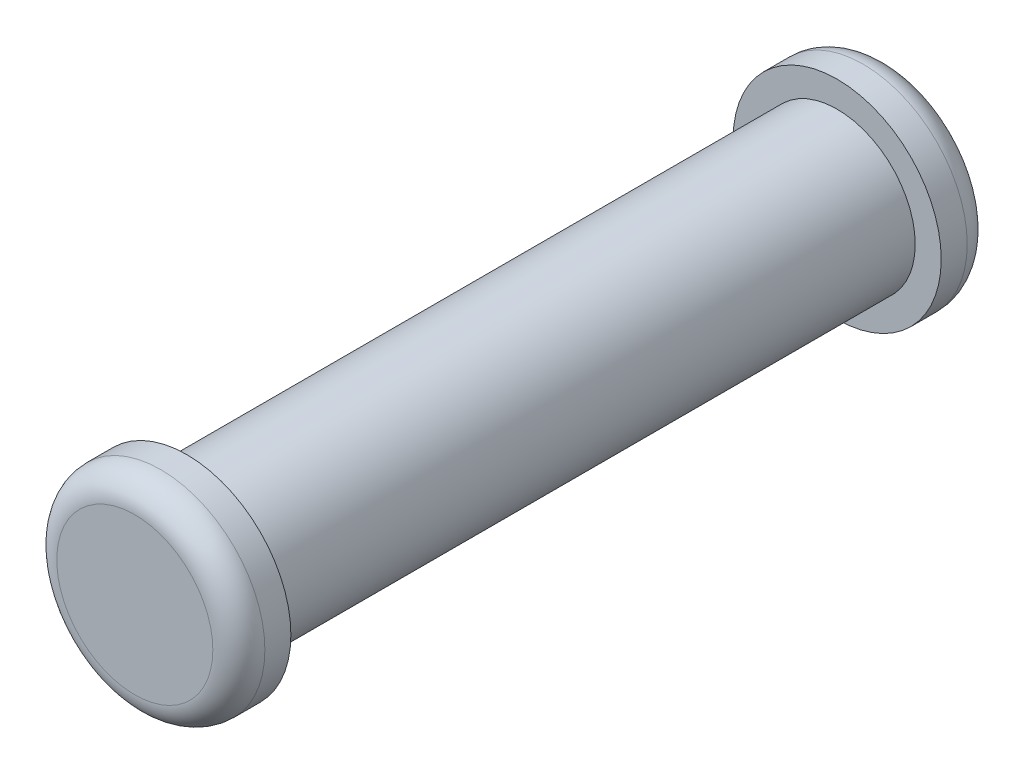
ISO-10303-21;
HEADER;
FILE_DESCRIPTION(('STEP AP214'),'2;1');
FILE_NAME('part.step','',(''),(''),'','','');
FILE_SCHEMA(('AUTOMOTIVE_DESIGN { 1 0 10303 214 1 1 1 1 }'));
ENDSEC;
DATA;
#1=APPLICATION_CONTEXT('core data for automotive mechanical design processes');
#2=APPLICATION_PROTOCOL_DEFINITION('international standard','automotive_design',2000,#1);
#3=PRODUCT_CONTEXT('',#1,'mechanical');
#4=PRODUCT('Part','Part','',(#3));
#5=PRODUCT_RELATED_PRODUCT_CATEGORY('part','',(#4));
#6=PRODUCT_DEFINITION_FORMATION('','',#4);
#7=PRODUCT_DEFINITION_CONTEXT('part definition',#1,'design');
#8=PRODUCT_DEFINITION('design','',#6,#7);
#9=PRODUCT_DEFINITION_SHAPE('','',#8);
#10=(LENGTH_UNIT() NAMED_UNIT(*) SI_UNIT(.MILLI.,.METRE.));
#11=(NAMED_UNIT(*) PLANE_ANGLE_UNIT() SI_UNIT($,.RADIAN.));
#12=(NAMED_UNIT(*) SI_UNIT($,.STERADIAN.) SOLID_ANGLE_UNIT());
#13=UNCERTAINTY_MEASURE_WITH_UNIT(LENGTH_MEASURE(1.E-05),#10,'distance_accuracy_value','');
#14=(GEOMETRIC_REPRESENTATION_CONTEXT(3) GLOBAL_UNCERTAINTY_ASSIGNED_CONTEXT((#13)) GLOBAL_UNIT_ASSIGNED_CONTEXT((#10,
#11,#12)) REPRESENTATION_CONTEXT('',''));
#15=CARTESIAN_POINT('',(0.,0.,0.));
#16=DIRECTION('',(0.,0.,1.));
#17=DIRECTION('',(1.,0.,0.));
#18=AXIS2_PLACEMENT_3D('',#15,#16,#17);
#19=CARTESIAN_POINT('',(0.,0.,12.5));
#20=DIRECTION('',(0.,0.,-1.));
#21=DIRECTION('',(-1.,0.,0.));
#22=AXIS2_PLACEMENT_3D('',#19,#20,#21);
#23=CYLINDRICAL_SURFACE('',#22,1.5);
#24=CARTESIAN_POINT('',(0.,0.,12.5));
#25=DIRECTION('',(0.,0.,1.));
#26=DIRECTION('',(1.,0.,0.));
#27=AXIS2_PLACEMENT_3D('',#24,#25,#26);
#28=CIRCLE('',#27,1.5);
#29=CARTESIAN_POINT('',(1.5,0.,12.5));
#30=VERTEX_POINT('',#29);
#31=EDGE_CURVE('E59',#30,#30,#28,.T.);
#32=ORIENTED_EDGE('',*,*,#31,.F.);
#33=EDGE_LOOP('',(#32));
#34=FACE_BOUND('',#33,.T.);
#35=CARTESIAN_POINT('',(0.,0.,0.));
#36=DIRECTION('',(0.,0.,1.));
#37=DIRECTION('',(1.,0.,0.));
#38=AXIS2_PLACEMENT_3D('',#35,#36,#37);
#39=CIRCLE('',#38,1.5);
#40=CARTESIAN_POINT('',(1.5,0.,0.));
#41=VERTEX_POINT('',#40);
#42=EDGE_CURVE('E60',#41,#41,#39,.T.);
#43=ORIENTED_EDGE('',*,*,#42,.T.);
#44=EDGE_LOOP('',(#43));
#45=FACE_BOUND('',#44,.T.);
#46=ADVANCED_FACE('F39',(#34,#45),#23,.T.);
#47=CARTESIAN_POINT('',(0.,0.,-1.));
#48=DIRECTION('',(0.,0.,1.));
#49=DIRECTION('',(1.,0.,0.));
#50=AXIS2_PLACEMENT_3D('',#47,#48,#49);
#51=CYLINDRICAL_SURFACE('',#50,2.);
#52=CARTESIAN_POINT('',(0.,0.,-0.5));
#53=DIRECTION('',(0.,0.,-1.));
#54=DIRECTION('',(-1.,0.,0.));
#55=AXIS2_PLACEMENT_3D('',#52,#53,#54);
#56=CIRCLE('',#55,2.);
#57=CARTESIAN_POINT('',(-2.,0.,-0.5));
#58=VERTEX_POINT('',#57);
#59=EDGE_CURVE('E50',#58,#58,#56,.F.);
#60=ORIENTED_EDGE('',*,*,#59,.T.);
#61=EDGE_LOOP('',(#60));
#62=FACE_BOUND('',#61,.T.);
#63=CARTESIAN_POINT('',(0.,0.,0.));
#64=DIRECTION('',(0.,0.,-1.));
#65=DIRECTION('',(-1.,0.,0.));
#66=AXIS2_PLACEMENT_3D('',#63,#64,#65);
#67=CIRCLE('',#66,2.);
#68=CARTESIAN_POINT('',(-2.,0.,0.));
#69=VERTEX_POINT('',#68);
#70=EDGE_CURVE('E63',#69,#69,#67,.T.);
#71=ORIENTED_EDGE('',*,*,#70,.T.);
#72=EDGE_LOOP('',(#71));
#73=FACE_BOUND('',#72,.T.);
#74=ADVANCED_FACE('F90',(#62,#73),#51,.T.);
#75=CARTESIAN_POINT('',(0.,0.,-1.));
#76=DIRECTION('',(0.,0.,-1.));
#77=DIRECTION('',(-1.,0.,0.));
#78=AXIS2_PLACEMENT_3D('',#75,#76,#77);
#79=PLANE('',#78);
#80=CARTESIAN_POINT('',(0.,0.,-1.));
#81=DIRECTION('',(0.,0.,-1.));
#82=DIRECTION('',(-1.,0.,0.));
#83=AXIS2_PLACEMENT_3D('',#80,#81,#82);
#84=CIRCLE('',#83,1.5);
#85=CARTESIAN_POINT('',(-1.5,0.,-1.));
#86=VERTEX_POINT('',#85);
#87=EDGE_CURVE('E54',#86,#86,#84,.T.);
#88=ORIENTED_EDGE('',*,*,#87,.T.);
#89=EDGE_LOOP('',(#88));
#90=FACE_BOUND('',#89,.T.);
#91=ADVANCED_FACE('F95',(#90),#79,.T.);
#92=CARTESIAN_POINT('',(0.,0.,0.));
#93=DIRECTION('',(0.,0.,-1.));
#94=DIRECTION('',(-1.,0.,0.));
#95=AXIS2_PLACEMENT_3D('',#92,#93,#94);
#96=PLANE('',#95);
#97=ORIENTED_EDGE('',*,*,#42,.F.);
#98=EDGE_LOOP('',(#97));
#99=FACE_BOUND('',#98,.T.);
#100=ORIENTED_EDGE('',*,*,#70,.F.);
#101=EDGE_LOOP('',(#100));
#102=FACE_BOUND('',#101,.T.);
#103=ADVANCED_FACE('F101',(#99,#102),#96,.F.);
#104=CARTESIAN_POINT('',(0.,0.,13.5));
#105=DIRECTION('',(0.,0.,-1.));
#106=DIRECTION('',(-1.,0.,0.));
#107=AXIS2_PLACEMENT_3D('',#104,#105,#106);
#108=CYLINDRICAL_SURFACE('',#107,2.);
#109=CARTESIAN_POINT('',(0.,0.,13.));
#110=DIRECTION('',(0.,0.,1.));
#111=DIRECTION('',(1.,0.,0.));
#112=AXIS2_PLACEMENT_3D('',#109,#110,#111);
#113=CIRCLE('',#112,2.);
#114=CARTESIAN_POINT('',(2.,0.,13.));
#115=VERTEX_POINT('',#114);
#116=EDGE_CURVE('E10',#115,#115,#113,.F.);
#117=ORIENTED_EDGE('',*,*,#116,.T.);
#118=EDGE_LOOP('',(#117));
#119=FACE_BOUND('',#118,.T.);
#120=CARTESIAN_POINT('',(0.,0.,12.5));
#121=DIRECTION('',(0.,0.,1.));
#122=DIRECTION('',(1.,0.,0.));
#123=AXIS2_PLACEMENT_3D('',#120,#121,#122);
#124=CIRCLE('',#123,2.);
#125=CARTESIAN_POINT('',(2.,0.,12.5));
#126=VERTEX_POINT('',#125);
#127=EDGE_CURVE('E68',#126,#126,#124,.T.);
#128=ORIENTED_EDGE('',*,*,#127,.T.);
#129=EDGE_LOOP('',(#128));
#130=FACE_BOUND('',#129,.T.);
#131=ADVANCED_FACE('F72',(#119,#130),#108,.T.);
#132=CARTESIAN_POINT('',(0.,0.,13.5));
#133=DIRECTION('',(0.,0.,1.));
#134=DIRECTION('',(1.,0.,0.));
#135=AXIS2_PLACEMENT_3D('',#132,#133,#134);
#136=PLANE('',#135);
#137=CARTESIAN_POINT('',(0.,0.,13.5));
#138=DIRECTION('',(0.,0.,1.));
#139=DIRECTION('',(1.,0.,0.));
#140=AXIS2_PLACEMENT_3D('',#137,#138,#139);
#141=CIRCLE('',#140,1.5);
#142=CARTESIAN_POINT('',(1.5,0.,13.5));
#143=VERTEX_POINT('',#142);
#144=EDGE_CURVE('E46',#143,#143,#141,.T.);
#145=ORIENTED_EDGE('',*,*,#144,.T.);
#146=EDGE_LOOP('',(#145));
#147=FACE_BOUND('',#146,.T.);
#148=ADVANCED_FACE('F77',(#147),#136,.T.);
#149=CARTESIAN_POINT('',(0.,0.,12.5));
#150=DIRECTION('',(0.,0.,1.));
#151=DIRECTION('',(1.,0.,0.));
#152=AXIS2_PLACEMENT_3D('',#149,#150,#151);
#153=PLANE('',#152);
#154=ORIENTED_EDGE('',*,*,#31,.T.);
#155=EDGE_LOOP('',(#154));
#156=FACE_BOUND('',#155,.T.);
#157=ORIENTED_EDGE('',*,*,#127,.F.);
#158=EDGE_LOOP('',(#157));
#159=FACE_BOUND('',#158,.T.);
#160=ADVANCED_FACE('F74',(#156,#159),#153,.F.);
#161=CARTESIAN_POINT('',(0.,0.,-0.5));
#162=DIRECTION('',(0.,0.,-1.));
#163=DIRECTION('',(-1.,0.,0.));
#164=AXIS2_PLACEMENT_3D('',#161,#162,#163);
#165=TOROIDAL_SURFACE('',#164,1.5,0.5);
#166=ORIENTED_EDGE('',*,*,#59,.F.);
#167=EDGE_LOOP('',(#166));
#168=FACE_BOUND('',#167,.T.);
#169=ORIENTED_EDGE('',*,*,#87,.F.);
#170=EDGE_LOOP('',(#169));
#171=FACE_BOUND('',#170,.T.);
#172=ADVANCED_FACE('F76',(#168,#171),#165,.T.);
#173=CARTESIAN_POINT('',(0.,0.,13.));
#174=DIRECTION('',(0.,0.,1.));
#175=DIRECTION('',(1.,0.,0.));
#176=AXIS2_PLACEMENT_3D('',#173,#174,#175);
#177=TOROIDAL_SURFACE('',#176,1.5,0.5);
#178=ORIENTED_EDGE('',*,*,#116,.F.);
#179=EDGE_LOOP('',(#178));
#180=FACE_BOUND('',#179,.T.);
#181=ORIENTED_EDGE('',*,*,#144,.F.);
#182=EDGE_LOOP('',(#181));
#183=FACE_BOUND('',#182,.T.);
#184=ADVANCED_FACE('F41',(#180,#183),#177,.T.);
#185=CLOSED_SHELL('',(#46,#74,#91,#103,#131,#148,#160,#172,#184));
#186=MANIFOLD_SOLID_BREP('B2',#185);
#187=ADVANCED_BREP_SHAPE_REPRESENTATION('',(#18,#186),#14);
#188=SHAPE_DEFINITION_REPRESENTATION(#9,#187);
ENDSEC;
END-ISO-10303-21;
